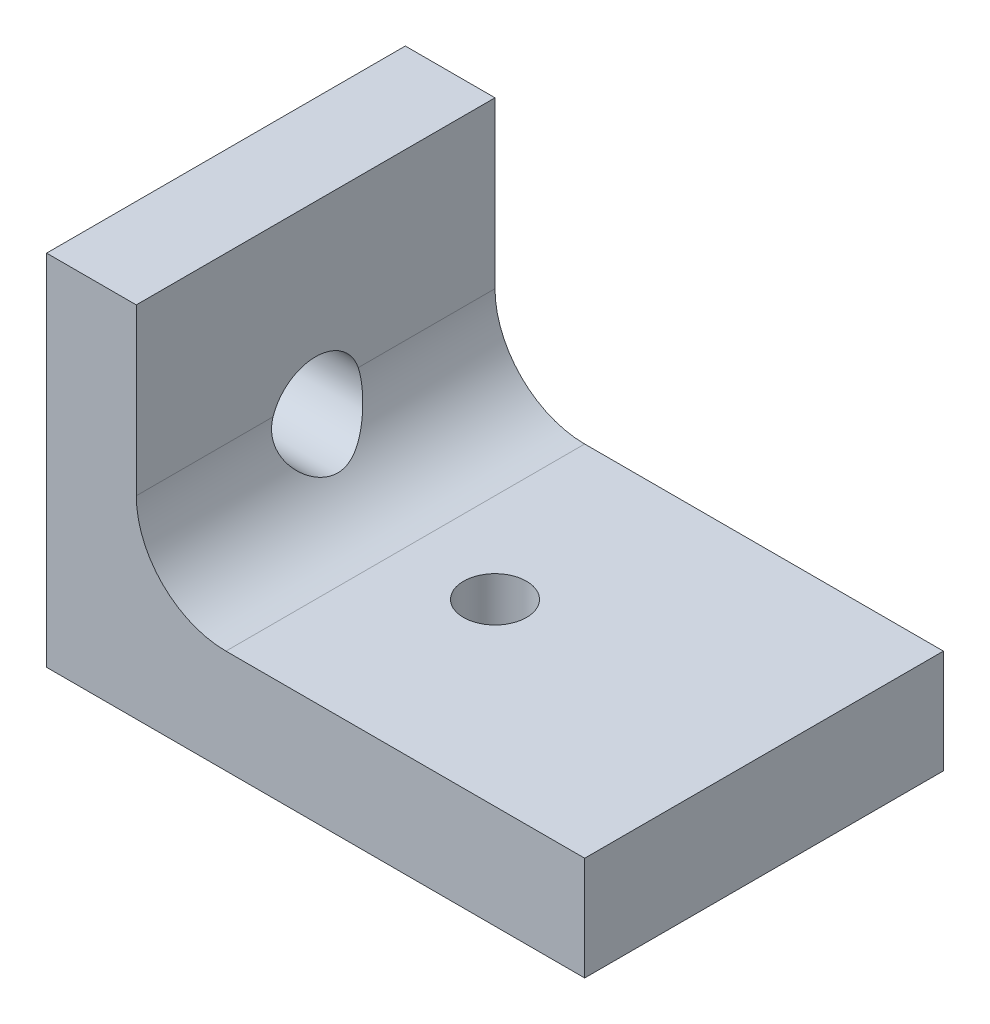
ISO-10303-21;
HEADER;
FILE_DESCRIPTION(('STEP AP214'),'2;1');
FILE_NAME('part.step','',(''),(''),'','','');
FILE_SCHEMA(('AUTOMOTIVE_DESIGN { 1 0 10303 214 1 1 1 1 }'));
ENDSEC;
DATA;
#1=APPLICATION_CONTEXT('core data for automotive mechanical design processes');
#2=APPLICATION_PROTOCOL_DEFINITION('international standard','automotive_design',2000,#1);
#3=PRODUCT_CONTEXT('',#1,'mechanical');
#4=PRODUCT('Part','Part','',(#3));
#5=PRODUCT_RELATED_PRODUCT_CATEGORY('part','',(#4));
#6=PRODUCT_DEFINITION_FORMATION('','',#4);
#7=PRODUCT_DEFINITION_CONTEXT('part definition',#1,'design');
#8=PRODUCT_DEFINITION('design','',#6,#7);
#9=PRODUCT_DEFINITION_SHAPE('','',#8);
#10=(LENGTH_UNIT() NAMED_UNIT(*) SI_UNIT(.MILLI.,.METRE.));
#11=(NAMED_UNIT(*) PLANE_ANGLE_UNIT() SI_UNIT($,.RADIAN.));
#12=(NAMED_UNIT(*) SI_UNIT($,.STERADIAN.) SOLID_ANGLE_UNIT());
#13=UNCERTAINTY_MEASURE_WITH_UNIT(LENGTH_MEASURE(1.E-05),#10,'distance_accuracy_value','');
#14=(GEOMETRIC_REPRESENTATION_CONTEXT(3) GLOBAL_UNCERTAINTY_ASSIGNED_CONTEXT((#13)) GLOBAL_UNIT_ASSIGNED_CONTEXT((#10,
#11,#12)) REPRESENTATION_CONTEXT('',''));
#15=CARTESIAN_POINT('',(0.,0.,0.));
#16=DIRECTION('',(0.,0.,1.));
#17=DIRECTION('',(1.,0.,0.));
#18=AXIS2_PLACEMENT_3D('',#15,#16,#17);
#19=CARTESIAN_POINT('',(0.,20.,20.));
#20=DIRECTION('',(0.,-1.,0.));
#21=DIRECTION('',(0.,0.,-1.));
#22=AXIS2_PLACEMENT_3D('',#19,#20,#21);
#23=PLANE('',#22);
#24=DIRECTION('',(-1.,0.,0.));
#25=VECTOR('',#24,1.);
#26=CARTESIAN_POINT('',(0.,20.,0.));
#27=LINE('',#26,#25);
#28=CARTESIAN_POINT('',(5.,20.,0.));
#29=VERTEX_POINT('',#28);
#30=CARTESIAN_POINT('',(0.,20.,0.));
#31=VERTEX_POINT('',#30);
#32=EDGE_CURVE('E134',#29,#31,#27,.T.);
#33=ORIENTED_EDGE('',*,*,#32,.T.);
#34=DIRECTION('',(0.,0.,-1.));
#35=VECTOR('',#34,1.);
#36=CARTESIAN_POINT('',(0.,20.,20.));
#37=LINE('',#36,#35);
#38=CARTESIAN_POINT('',(0.,20.,20.));
#39=VERTEX_POINT('',#38);
#40=EDGE_CURVE('E40',#39,#31,#37,.T.);
#41=ORIENTED_EDGE('',*,*,#40,.F.);
#42=DIRECTION('',(-1.,0.,0.));
#43=VECTOR('',#42,1.);
#44=CARTESIAN_POINT('',(0.,20.,20.));
#45=LINE('',#44,#43);
#46=CARTESIAN_POINT('',(5.,20.,20.));
#47=VERTEX_POINT('',#46);
#48=EDGE_CURVE('E148',#47,#39,#45,.T.);
#49=ORIENTED_EDGE('',*,*,#48,.F.);
#50=DIRECTION('',(0.,0.,-1.));
#51=VECTOR('',#50,1.);
#52=CARTESIAN_POINT('',(5.,20.,20.));
#53=LINE('',#52,#51);
#54=EDGE_CURVE('E130',#47,#29,#53,.T.);
#55=ORIENTED_EDGE('',*,*,#54,.T.);
#56=EDGE_LOOP('',(#33,#41,#49,#55));
#57=FACE_BOUND('',#56,.T.);
#58=ADVANCED_FACE('F33',(#57),#23,.F.);
#59=CARTESIAN_POINT('',(0.,20.,20.));
#60=DIRECTION('',(1.,0.,0.));
#61=DIRECTION('',(0.,1.,0.));
#62=AXIS2_PLACEMENT_3D('',#59,#60,#61);
#63=PLANE('',#62);
#64=CARTESIAN_POINT('',(0.,10.,10.));
#65=DIRECTION('',(-1.,0.,0.));
#66=DIRECTION('',(0.,-1.,0.));
#67=AXIS2_PLACEMENT_3D('',#64,#65,#66);
#68=CIRCLE('',#67,2.5);
#69=CARTESIAN_POINT('',(0.,7.5,10.));
#70=VERTEX_POINT('',#69);
#71=EDGE_CURVE('E167',#70,#70,#68,.T.);
#72=ORIENTED_EDGE('',*,*,#71,.F.);
#73=EDGE_LOOP('',(#72));
#74=FACE_BOUND('',#73,.T.);
#75=DIRECTION('',(0.,-1.,0.));
#76=VECTOR('',#75,1.);
#77=CARTESIAN_POINT('',(0.,20.,0.));
#78=LINE('',#77,#76);
#79=CARTESIAN_POINT('',(0.,0.,0.));
#80=VERTEX_POINT('',#79);
#81=EDGE_CURVE('E137',#31,#80,#78,.T.);
#82=ORIENTED_EDGE('',*,*,#81,.T.);
#83=DIRECTION('',(0.,0.,-1.));
#84=VECTOR('',#83,1.);
#85=CARTESIAN_POINT('',(0.,0.,20.));
#86=LINE('',#85,#84);
#87=CARTESIAN_POINT('',(0.,0.,20.));
#88=VERTEX_POINT('',#87);
#89=EDGE_CURVE('E156',#88,#80,#86,.T.);
#90=ORIENTED_EDGE('',*,*,#89,.F.);
#91=DIRECTION('',(0.,-1.,0.));
#92=VECTOR('',#91,1.);
#93=CARTESIAN_POINT('',(0.,20.,20.));
#94=LINE('',#93,#92);
#95=EDGE_CURVE('E92',#39,#88,#94,.T.);
#96=ORIENTED_EDGE('',*,*,#95,.F.);
#97=ORIENTED_EDGE('',*,*,#40,.T.);
#98=EDGE_LOOP('',(#82,#90,#96,#97));
#99=FACE_BOUND('',#98,.T.);
#100=ADVANCED_FACE('F203',(#74,#99),#63,.F.);
#101=CARTESIAN_POINT('',(0.,0.,20.));
#102=DIRECTION('',(0.,1.,0.));
#103=DIRECTION('',(0.,0.,1.));
#104=AXIS2_PLACEMENT_3D('',#101,#102,#103);
#105=PLANE('',#104);
#106=CARTESIAN_POINT('',(15.,0.,10.));
#107=DIRECTION('',(0.,-1.,0.));
#108=DIRECTION('',(0.,0.,-1.));
#109=AXIS2_PLACEMENT_3D('',#106,#107,#108);
#110=CIRCLE('',#109,1.755);
#111=CARTESIAN_POINT('',(15.,0.,8.245));
#112=VERTEX_POINT('',#111);
#113=EDGE_CURVE('E160',#112,#112,#110,.T.);
#114=ORIENTED_EDGE('',*,*,#113,.F.);
#115=EDGE_LOOP('',(#114));
#116=FACE_BOUND('',#115,.T.);
#117=DIRECTION('',(1.,0.,0.));
#118=VECTOR('',#117,1.);
#119=CARTESIAN_POINT('',(0.,0.,0.));
#120=LINE('',#119,#118);
#121=CARTESIAN_POINT('',(30.,0.,0.));
#122=VERTEX_POINT('',#121);
#123=EDGE_CURVE('E140',#80,#122,#120,.T.);
#124=ORIENTED_EDGE('',*,*,#123,.T.);
#125=DIRECTION('',(0.,0.,-1.));
#126=VECTOR('',#125,1.);
#127=CARTESIAN_POINT('',(30.,0.,20.));
#128=LINE('',#127,#126);
#129=CARTESIAN_POINT('',(30.,0.,20.));
#130=VERTEX_POINT('',#129);
#131=EDGE_CURVE('E153',#130,#122,#128,.T.);
#132=ORIENTED_EDGE('',*,*,#131,.F.);
#133=DIRECTION('',(1.,0.,0.));
#134=VECTOR('',#133,1.);
#135=CARTESIAN_POINT('',(0.,0.,20.));
#136=LINE('',#135,#134);
#137=EDGE_CURVE('E179',#88,#130,#136,.T.);
#138=ORIENTED_EDGE('',*,*,#137,.F.);
#139=ORIENTED_EDGE('',*,*,#89,.T.);
#140=EDGE_LOOP('',(#124,#132,#138,#139));
#141=FACE_BOUND('',#140,.T.);
#142=ADVANCED_FACE('F183',(#116,#141),#105,.F.);
#143=CARTESIAN_POINT('',(30.,5.78313253012047,20.));
#144=DIRECTION('',(-1.,0.,0.));
#145=DIRECTION('',(0.,-1.,0.));
#146=AXIS2_PLACEMENT_3D('',#143,#144,#145);
#147=PLANE('',#146);
#148=DIRECTION('',(0.,1.,0.));
#149=VECTOR('',#148,1.);
#150=CARTESIAN_POINT('',(30.,5.78313253012047,0.));
#151=LINE('',#150,#149);
#152=CARTESIAN_POINT('',(30.,5.78313253012047,0.));
#153=VERTEX_POINT('',#152);
#154=EDGE_CURVE('E142',#122,#153,#151,.T.);
#155=ORIENTED_EDGE('',*,*,#154,.T.);
#156=DIRECTION('',(0.,0.,-1.));
#157=VECTOR('',#156,1.);
#158=CARTESIAN_POINT('',(30.,5.78313253012047,20.));
#159=LINE('',#158,#157);
#160=CARTESIAN_POINT('',(30.,5.78313253012047,20.));
#161=VERTEX_POINT('',#160);
#162=EDGE_CURVE('E123',#161,#153,#159,.T.);
#163=ORIENTED_EDGE('',*,*,#162,.F.);
#164=DIRECTION('',(0.,1.,0.));
#165=VECTOR('',#164,1.);
#166=CARTESIAN_POINT('',(30.,5.78313253012047,20.));
#167=LINE('',#166,#165);
#168=EDGE_CURVE('E110',#130,#161,#167,.T.);
#169=ORIENTED_EDGE('',*,*,#168,.F.);
#170=ORIENTED_EDGE('',*,*,#131,.T.);
#171=EDGE_LOOP('',(#155,#163,#169,#170));
#172=FACE_BOUND('',#171,.T.);
#173=ADVANCED_FACE('F187',(#172),#147,.F.);
#174=CARTESIAN_POINT('',(9.99999999999999,5.78313253012047,20.));
#175=DIRECTION('',(0.,-1.,0.));
#176=DIRECTION('',(0.,0.,-1.));
#177=AXIS2_PLACEMENT_3D('',#174,#175,#176);
#178=PLANE('',#177);
#179=CARTESIAN_POINT('',(15.,5.78313253012047,10.));
#180=DIRECTION('',(0.,-1.,0.));
#181=DIRECTION('',(0.,0.,-1.));
#182=AXIS2_PLACEMENT_3D('',#179,#180,#181);
#183=CIRCLE('',#182,1.755);
#184=CARTESIAN_POINT('',(15.,5.78313253012047,8.245));
#185=VERTEX_POINT('',#184);
#186=EDGE_CURVE('E138',#185,#185,#183,.T.);
#187=ORIENTED_EDGE('',*,*,#186,.T.);
#188=EDGE_LOOP('',(#187));
#189=FACE_BOUND('',#188,.T.);
#190=DIRECTION('',(-1.,0.,0.));
#191=VECTOR('',#190,1.);
#192=CARTESIAN_POINT('',(9.99999999999999,5.78313253012047,0.));
#193=LINE('',#192,#191);
#194=CARTESIAN_POINT('',(9.99999999999999,5.78313253012047,0.));
#195=VERTEX_POINT('',#194);
#196=EDGE_CURVE('E119',#153,#195,#193,.T.);
#197=ORIENTED_EDGE('',*,*,#196,.T.);
#198=DIRECTION('',(0.,0.,-1.));
#199=VECTOR('',#198,1.);
#200=CARTESIAN_POINT('',(9.99999999999999,5.78313253012047,20.));
#201=LINE('',#200,#199);
#202=CARTESIAN_POINT('',(9.99999999999999,5.78313253012047,20.));
#203=VERTEX_POINT('',#202);
#204=EDGE_CURVE('E116',#203,#195,#201,.T.);
#205=ORIENTED_EDGE('',*,*,#204,.F.);
#206=DIRECTION('',(-1.,0.,0.));
#207=VECTOR('',#206,1.);
#208=CARTESIAN_POINT('',(9.99999999999999,5.78313253012047,20.));
#209=LINE('',#208,#207);
#210=EDGE_CURVE('E103',#161,#203,#209,.T.);
#211=ORIENTED_EDGE('',*,*,#210,.F.);
#212=ORIENTED_EDGE('',*,*,#162,.T.);
#213=EDGE_LOOP('',(#197,#205,#211,#212));
#214=FACE_BOUND('',#213,.T.);
#215=ADVANCED_FACE('F117',(#189,#214),#178,.F.);
#216=CARTESIAN_POINT('',(9.99999999999999,10.7831325301205,20.));
#217=DIRECTION('',(0.,0.,-1.));
#218=DIRECTION('',(-1.,0.,0.));
#219=AXIS2_PLACEMENT_3D('',#216,#217,#218);
#220=CYLINDRICAL_SURFACE('',#219,5.);
#221=DIRECTION('',(0.,0.,-1.));
#222=VECTOR('',#221,1.);
#223=CARTESIAN_POINT('',(5.,10.7831325301205,20.));
#224=LINE('',#223,#222);
#225=CARTESIAN_POINT('',(5.,10.7831325301205,7.62582573506764));
#226=VERTEX_POINT('',#225);
#227=CARTESIAN_POINT('',(5.,10.7831325301205,0.));
#228=VERTEX_POINT('',#227);
#229=EDGE_CURVE('E150',#226,#228,#224,.T.);
#230=ORIENTED_EDGE('',*,*,#229,.F.);
#231=CARTESIAN_POINT('',(5.,10.7831325301205,7.62582573506764));
#232=CARTESIAN_POINT('',(4.9999900467211,10.721867406554,7.60560669193163));
#233=CARTESIAN_POINT('',(5.00112579814433,10.659813288219,7.58777779324875));
#234=CARTESIAN_POINT('',(5.00579008170728,10.5346053332278,7.55698131063365));
#235=CARTESIAN_POINT('',(5.00931837783493,10.4714516056412,7.54401324740122));
#236=CARTESIAN_POINT('',(5.01885181403281,10.3447399202152,7.52305340229183));
#237=CARTESIAN_POINT('',(5.02484795254213,10.281184249547,7.51504379738549));
#238=CARTESIAN_POINT('',(5.03933113841473,10.1539473690121,7.50392614104921));
#239=CARTESIAN_POINT('',(5.04781811510433,10.0902661627583,7.50081795056519));
#240=CARTESIAN_POINT('',(5.07699191215198,9.8997147724493,7.49879341137249));
#241=CARTESIAN_POINT('',(5.10139830939374,9.77324652245325,7.50716243583501));
#242=CARTESIAN_POINT('',(5.15917477637114,9.52507598041391,7.54231751699703));
#243=CARTESIAN_POINT('',(5.19254947729282,9.40337618808691,7.56911310025467));
#244=CARTESIAN_POINT('',(5.26792025668854,9.16332564579458,7.64072263456279));
#245=CARTESIAN_POINT('',(5.31017112157577,9.04522988905409,7.68611884833037));
#246=CARTESIAN_POINT('',(5.40034365593053,8.81894598716316,7.79301228258333));
#247=CARTESIAN_POINT('',(5.44826753448017,8.71076173085161,7.85451578665488));
#248=CARTESIAN_POINT('',(5.55379969068845,8.49231404010627,8.00091263932602));
#249=CARTESIAN_POINT('',(5.61185716076282,8.3836073674264,8.08780690066477));
#250=CARTESIAN_POINT('',(5.72830567632284,8.18193570436441,8.27839265190154));
#251=CARTESIAN_POINT('',(5.78669711833152,8.08899746423526,8.38211211324218));
#252=CARTESIAN_POINT('',(5.90457613550482,7.91263407068459,8.61568361557008));
#253=CARTESIAN_POINT('',(5.96364069409281,7.83095188047942,8.74708229043157));
#254=CARTESIAN_POINT('',(6.06903669760454,7.69198875008637,9.0267235598814));
#255=CARTESIAN_POINT('',(6.1154074365013,7.63463219948119,9.17491212001308));
#256=CARTESIAN_POINT('',(6.17499227956154,7.56277138450426,9.4330144584163));
#257=CARTESIAN_POINT('',(6.19410010765454,7.54036843669408,9.53937837284893));
#258=CARTESIAN_POINT('',(6.2205279759557,7.50959914385645,9.7555123173739));
#259=CARTESIAN_POINT('',(6.22786263846813,7.50121538641404,9.86527794945006));
#260=CARTESIAN_POINT('',(6.22976531741356,7.49902926919238,10.085259485003));
#261=CARTESIAN_POINT('',(6.22431068606811,7.50525277654549,10.1954758417092));
#262=CARTESIAN_POINT('',(6.20134535745937,7.53189951068263,10.4129176244149));
#263=CARTESIAN_POINT('',(6.183824888395,7.55233424689498,10.5201405528254));
#264=CARTESIAN_POINT('',(6.13899981829644,7.60604662311856,10.7283483086023));
#265=CARTESIAN_POINT('',(6.11175621282762,7.63924429622738,10.8293675237712));
#266=CARTESIAN_POINT('',(6.05005161596957,7.71712998382811,11.0244771794926));
#267=CARTESIAN_POINT('',(6.01558808597743,7.76182204113056,11.1185651671814));
#268=CARTESIAN_POINT('',(5.93450003651103,7.87156267617093,11.3172308779469));
#269=CARTESIAN_POINT('',(5.8868236663315,7.93889751765973,11.4201134179824));
#270=CARTESIAN_POINT('',(5.7882730810899,8.08697171967159,11.6140725865866));
#271=CARTESIAN_POINT('',(5.73739586479969,8.16772378065164,11.7051378823407));
#272=CARTESIAN_POINT('',(5.62493981955712,8.35957427142538,11.892219102133));
#273=CARTESIAN_POINT('',(5.56332981039957,8.47349304905399,11.9853450668974));
#274=CARTESIAN_POINT('',(5.44454159901928,8.71765790773779,12.1511228738997));
#275=CARTESIAN_POINT('',(5.38736475004878,8.84790894281729,12.2237684820695));
#276=CARTESIAN_POINT('',(5.30782869371182,9.05423657691487,12.3154468580747));
#277=CARTESIAN_POINT('',(5.28222509705062,9.12528144344811,12.3432342843));
#278=CARTESIAN_POINT('',(5.23370631726225,9.27042482118211,12.3924010076231));
#279=CARTESIAN_POINT('',(5.21078971822913,9.34452169606531,12.4137836890026));
#280=CARTESIAN_POINT('',(5.16809432619877,9.49518366842783,12.4497249584615));
#281=CARTESIAN_POINT('',(5.14831338632947,9.57174703359943,12.4642882290092));
#282=CARTESIAN_POINT('',(5.11223802029155,9.72666858463466,12.4862450102048));
#283=CARTESIAN_POINT('',(5.0959425201731,9.80502620938058,12.4936407318384));
#284=CARTESIAN_POINT('',(5.05865795146366,10.0090207680744,12.503111844859));
#285=CARTESIAN_POINT('',(5.04050172917026,10.1354944246678,12.4995420375454));
#286=CARTESIAN_POINT('',(5.01409445057629,10.3872463434558,12.4730571043563));
#287=CARTESIAN_POINT('',(5.00582266721636,10.5125265586541,12.4501826317619));
#288=CARTESIAN_POINT('',(5.00144984017021,10.6601495226767,12.4114041169266));
#289=CARTESIAN_POINT('',(5.0009033970458,10.6849192195142,12.4044854064668));
#290=CARTESIAN_POINT('',(5.00017912885551,10.7342086321711,12.3898942352404));
#291=CARTESIAN_POINT('',(5.00000086051685,10.75872861319,12.3822226925405));
#292=CARTESIAN_POINT('',(5.,10.7831325301205,12.3741742649324));
#293=B_SPLINE_CURVE_WITH_KNOTS('',3,(#231,#232,#233,#234,#235,#236,#237,#238,#239,#240,#241,
#242,#243,#244,#245,#246,#247,#248,#249,#250,#251,#252,#253,#254,#255,#256,#257,#258,#259,#260,
#261,#262,#263,#264,#265,#266,#267,#268,#269,#270,#271,#272,#273,#274,#275,#276,#277,#278,#279,
#280,#281,#282,#283,#284,#285,#286,#287,#288,#289,#290,#291,#292),.UNSPECIFIED.,.F.,.F.,(4,2,2,
2,2,2,2,2,2,2,2,2,2,2,2,2,2,2,2,2,2,2,2,2,2,2,2,2,2,2,4),(0.,0.1934867576849,0.386954431684553,
0.579722591585832,0.772485282518457,1.15773906039962,1.54319216494567,1.9417652862496,
2.34049412641052,2.79103844002856,3.24233959572941,3.73652187427629,4.22915664372508,
4.55886831854201,4.88817017279924,5.21805560788321,5.54820852307809,5.87632569931291,
6.20455843928435,6.5987944241316,6.99340573294125,7.46985423022974,7.94644759869058,
8.18755292527637,8.42853062559571,8.66934261789844,8.91008030286235,9.29168062294147,
9.67247933854278,9.7496434351318,9.82671457388512),.UNSPECIFIED.);
#294=CARTESIAN_POINT('',(5.,10.7831325301205,12.3741742649324));
#295=VERTEX_POINT('',#294);
#296=EDGE_CURVE('E46',#226,#295,#293,.T.);
#297=ORIENTED_EDGE('',*,*,#296,.T.);
#298=CARTESIAN_POINT('',(5.,10.7831325301205,20.));
#299=VERTEX_POINT('',#298);
#300=EDGE_CURVE('E124',#299,#295,#224,.T.);
#301=ORIENTED_EDGE('',*,*,#300,.F.);
#302=CARTESIAN_POINT('',(9.99999999999999,10.7831325301205,20.));
#303=DIRECTION('',(0.,0.,-1.));
#304=DIRECTION('',(1.,0.,0.));
#305=AXIS2_PLACEMENT_3D('',#302,#303,#304);
#306=CIRCLE('',#305,5.);
#307=EDGE_CURVE('E107',#203,#299,#306,.T.);
#308=ORIENTED_EDGE('',*,*,#307,.F.);
#309=ORIENTED_EDGE('',*,*,#204,.T.);
#310=CARTESIAN_POINT('',(9.99999999999999,10.7831325301205,0.));
#311=DIRECTION('',(0.,0.,-1.));
#312=DIRECTION('',(1.,0.,0.));
#313=AXIS2_PLACEMENT_3D('',#310,#311,#312);
#314=CIRCLE('',#313,5.);
#315=EDGE_CURVE('E145',#195,#228,#314,.T.);
#316=ORIENTED_EDGE('',*,*,#315,.T.);
#317=EDGE_LOOP('',(#230,#297,#301,#308,#309,#316));
#318=FACE_BOUND('',#317,.T.);
#319=ADVANCED_FACE('F127',(#318),#220,.F.);
#320=CARTESIAN_POINT('',(5.,20.,20.));
#321=DIRECTION('',(-1.,0.,0.));
#322=DIRECTION('',(0.,-1.,0.));
#323=AXIS2_PLACEMENT_3D('',#320,#321,#322);
#324=PLANE('',#323);
#325=ORIENTED_EDGE('',*,*,#300,.T.);
#326=CARTESIAN_POINT('',(5.,10.,10.));
#327=DIRECTION('',(-1.,0.,0.));
#328=DIRECTION('',(0.,-1.,0.));
#329=AXIS2_PLACEMENT_3D('',#326,#327,#328);
#330=CIRCLE('',#329,2.5);
#331=EDGE_CURVE('E11',#295,#226,#330,.T.);
#332=ORIENTED_EDGE('',*,*,#331,.T.);
#333=ORIENTED_EDGE('',*,*,#229,.T.);
#334=DIRECTION('',(0.,1.,0.));
#335=VECTOR('',#334,1.);
#336=CARTESIAN_POINT('',(5.,20.,0.));
#337=LINE('',#336,#335);
#338=EDGE_CURVE('E83',#228,#29,#337,.T.);
#339=ORIENTED_EDGE('',*,*,#338,.T.);
#340=ORIENTED_EDGE('',*,*,#54,.F.);
#341=DIRECTION('',(0.,1.,0.));
#342=VECTOR('',#341,1.);
#343=CARTESIAN_POINT('',(5.,20.,20.));
#344=LINE('',#343,#342);
#345=EDGE_CURVE('E54',#299,#47,#344,.T.);
#346=ORIENTED_EDGE('',*,*,#345,.F.);
#347=EDGE_LOOP('',(#325,#332,#333,#339,#340,#346));
#348=FACE_BOUND('',#347,.T.);
#349=ADVANCED_FACE('F191',(#348),#324,.F.);
#350=CARTESIAN_POINT('',(9.99999999999999,10.7831325301205,20.));
#351=DIRECTION('',(0.,0.,1.));
#352=DIRECTION('',(1.,0.,0.));
#353=AXIS2_PLACEMENT_3D('',#350,#351,#352);
#354=PLANE('',#353);
#355=ORIENTED_EDGE('',*,*,#48,.T.);
#356=ORIENTED_EDGE('',*,*,#95,.T.);
#357=ORIENTED_EDGE('',*,*,#137,.T.);
#358=ORIENTED_EDGE('',*,*,#168,.T.);
#359=ORIENTED_EDGE('',*,*,#210,.T.);
#360=ORIENTED_EDGE('',*,*,#307,.T.);
#361=ORIENTED_EDGE('',*,*,#345,.T.);
#362=EDGE_LOOP('',(#355,#356,#357,#358,#359,#360,#361));
#363=FACE_BOUND('',#362,.T.);
#364=ADVANCED_FACE('F105',(#363),#354,.T.);
#365=CARTESIAN_POINT('',(9.99999999999999,10.7831325301205,0.));
#366=DIRECTION('',(0.,0.,1.));
#367=DIRECTION('',(1.,0.,0.));
#368=AXIS2_PLACEMENT_3D('',#365,#366,#367);
#369=PLANE('',#368);
#370=ORIENTED_EDGE('',*,*,#32,.F.);
#371=ORIENTED_EDGE('',*,*,#338,.F.);
#372=ORIENTED_EDGE('',*,*,#315,.F.);
#373=ORIENTED_EDGE('',*,*,#196,.F.);
#374=ORIENTED_EDGE('',*,*,#154,.F.);
#375=ORIENTED_EDGE('',*,*,#123,.F.);
#376=ORIENTED_EDGE('',*,*,#81,.F.);
#377=EDGE_LOOP('',(#370,#371,#372,#373,#374,#375,#376));
#378=FACE_BOUND('',#377,.T.);
#379=ADVANCED_FACE('F190',(#378),#369,.F.);
#380=CARTESIAN_POINT('',(15.,20.,10.));
#381=DIRECTION('',(0.,-1.,0.));
#382=DIRECTION('',(0.,0.,-1.));
#383=AXIS2_PLACEMENT_3D('',#380,#381,#382);
#384=CYLINDRICAL_SURFACE('',#383,1.755);
#385=ORIENTED_EDGE('',*,*,#113,.T.);
#386=EDGE_LOOP('',(#385));
#387=FACE_BOUND('',#386,.T.);
#388=ORIENTED_EDGE('',*,*,#186,.F.);
#389=EDGE_LOOP('',(#388));
#390=FACE_BOUND('',#389,.T.);
#391=ADVANCED_FACE('F194',(#387,#390),#384,.F.);
#392=CARTESIAN_POINT('',(20.,10.,10.));
#393=DIRECTION('',(-1.,0.,0.));
#394=DIRECTION('',(0.,-1.,0.));
#395=AXIS2_PLACEMENT_3D('',#392,#393,#394);
#396=CYLINDRICAL_SURFACE('',#395,2.5);
#397=ORIENTED_EDGE('',*,*,#71,.T.);
#398=EDGE_LOOP('',(#397));
#399=FACE_BOUND('',#398,.T.);
#400=ORIENTED_EDGE('',*,*,#331,.F.);
#401=ORIENTED_EDGE('',*,*,#296,.F.);
#402=EDGE_LOOP('',(#400,#401));
#403=FACE_BOUND('',#402,.T.);
#404=ADVANCED_FACE('F192',(#399,#403),#396,.F.);
#405=CLOSED_SHELL('',(#58,#100,#142,#173,#215,#319,#349,#364,#379,#391,#404));
#406=MANIFOLD_SOLID_BREP('B2',#405);
#407=ADVANCED_BREP_SHAPE_REPRESENTATION('',(#18,#406),#14);
#408=SHAPE_DEFINITION_REPRESENTATION(#9,#407);
ENDSEC;
END-ISO-10303-21;
